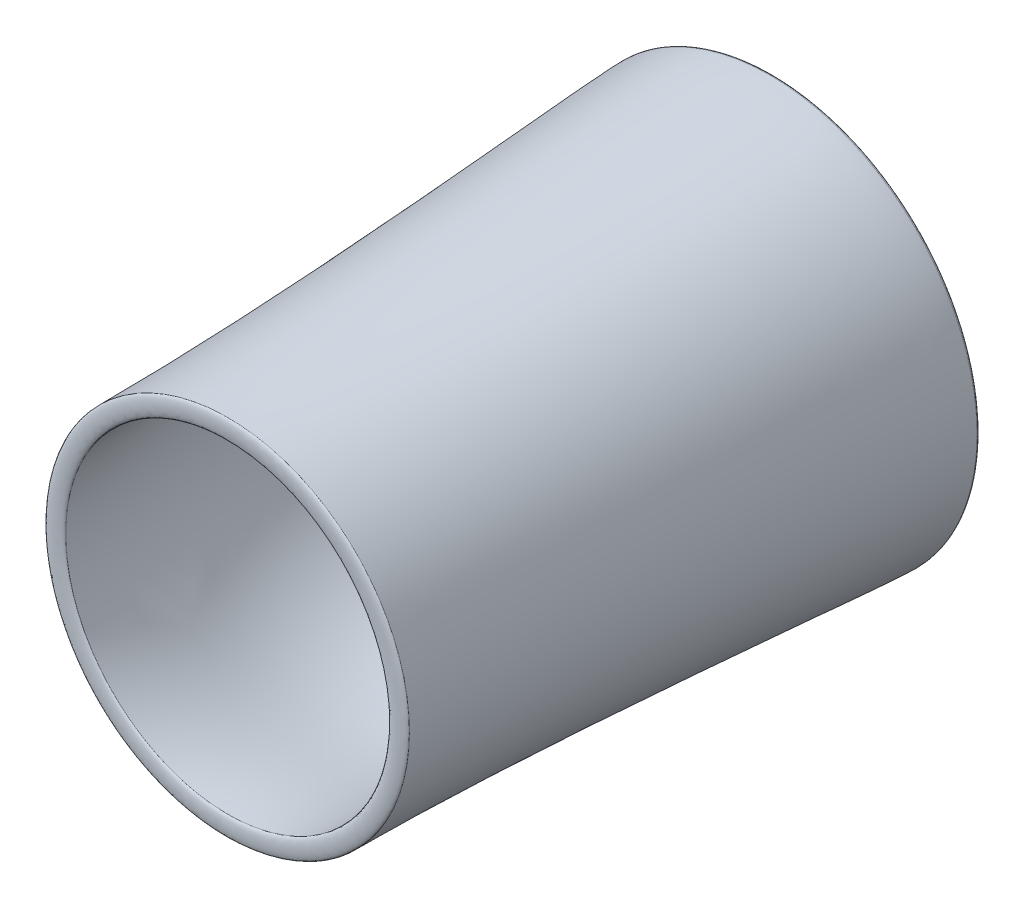
ISO-10303-21;
HEADER;
FILE_DESCRIPTION(('STEP AP214'),'2;1');
FILE_NAME('part.step','',(''),(''),'','','');
FILE_SCHEMA(('AUTOMOTIVE_DESIGN { 1 0 10303 214 1 1 1 1 }'));
ENDSEC;
DATA;
#1=APPLICATION_CONTEXT('core data for automotive mechanical design processes');
#2=APPLICATION_PROTOCOL_DEFINITION('international standard','automotive_design',2000,#1);
#3=PRODUCT_CONTEXT('',#1,'mechanical');
#4=PRODUCT('Part','Part','',(#3));
#5=PRODUCT_RELATED_PRODUCT_CATEGORY('part','',(#4));
#6=PRODUCT_DEFINITION_FORMATION('','',#4);
#7=PRODUCT_DEFINITION_CONTEXT('part definition',#1,'design');
#8=PRODUCT_DEFINITION('design','',#6,#7);
#9=PRODUCT_DEFINITION_SHAPE('','',#8);
#10=(LENGTH_UNIT() NAMED_UNIT(*) SI_UNIT(.MILLI.,.METRE.));
#11=(NAMED_UNIT(*) PLANE_ANGLE_UNIT() SI_UNIT($,.RADIAN.));
#12=(NAMED_UNIT(*) SI_UNIT($,.STERADIAN.) SOLID_ANGLE_UNIT());
#13=UNCERTAINTY_MEASURE_WITH_UNIT(LENGTH_MEASURE(1.E-05),#10,'distance_accuracy_value','');
#14=(GEOMETRIC_REPRESENTATION_CONTEXT(3) GLOBAL_UNCERTAINTY_ASSIGNED_CONTEXT((#13)) GLOBAL_UNIT_ASSIGNED_CONTEXT((#10,
#11,#12)) REPRESENTATION_CONTEXT('',''));
#15=CARTESIAN_POINT('',(0.,0.,0.));
#16=DIRECTION('',(0.,0.,1.));
#17=DIRECTION('',(1.,0.,0.));
#18=AXIS2_PLACEMENT_3D('',#15,#16,#17);
#19=CARTESIAN_POINT('',(-623.081922494606,0.,1297.82214060175));
#20=CARTESIAN_POINT('',(-623.081922494606,0.,1310.52214060175));
#21=CARTESIAN_POINT('',(-556.631697094474,0.,1310.52214060175));
#22=CARTESIAN_POINT('',(-556.631697094474,0.,1297.82214060175));
#23=B_SPLINE_CURVE_WITH_KNOTS('',3,(#19,#20,#21,#22),.UNSPECIFIED.,.F.,.F.,(4,4),(0.,1.),.UNSPECIFIED.);
#24=CARTESIAN_POINT('',(0.,0.,1104.75683012291));
#25=DIRECTION('',(0.,0.,1.));
#26=AXIS1_PLACEMENT('',#24,#25);
#27=SURFACE_OF_REVOLUTION('',#23,#26);
#28=CARTESIAN_POINT('',(0.,0.,1297.82214060175));
#29=DIRECTION('',(0.,0.,1.));
#30=DIRECTION('',(1.,0.,0.));
#31=AXIS2_PLACEMENT_3D('',#28,#29,#30);
#32=CIRCLE('',#31,556.631697094474);
#33=CARTESIAN_POINT('',(556.631697094474,0.,1297.82214060175));
#34=VERTEX_POINT('',#33);
#35=EDGE_CURVE('E47',#34,#34,#32,.T.);
#36=ORIENTED_EDGE('',*,*,#35,.F.);
#37=EDGE_LOOP('',(#36));
#38=FACE_BOUND('',#37,.T.);
#39=CARTESIAN_POINT('',(0.,0.,1297.82214060175));
#40=DIRECTION('',(0.,0.,1.));
#41=DIRECTION('',(1.,0.,0.));
#42=AXIS2_PLACEMENT_3D('',#39,#40,#41);
#43=CIRCLE('',#42,623.081922494606);
#44=CARTESIAN_POINT('',(623.081922494606,0.,1297.82214060175));
#45=VERTEX_POINT('',#44);
#46=EDGE_CURVE('E11',#45,#45,#43,.T.);
#47=ORIENTED_EDGE('',*,*,#46,.T.);
#48=EDGE_LOOP('',(#47));
#49=FACE_BOUND('',#48,.T.);
#50=ADVANCED_FACE('F40',(#38,#49),#27,.T.);
#51=CARTESIAN_POINT('',(-623.081922494606,0.,1297.82214060175));
#52=DIRECTION('',(0.,0.,1.));
#53=DIRECTION('',(1.,0.,0.));
#54=AXIS2_PLACEMENT_3D('',#51,#52,#53);
#55=PLANE('',#54);
#56=ORIENTED_EDGE('',*,*,#46,.F.);
#57=EDGE_LOOP('',(#56));
#58=FACE_BOUND('',#57,.T.);
#59=ORIENTED_EDGE('',*,*,#35,.T.);
#60=EDGE_LOOP('',(#59));
#61=FACE_BOUND('',#60,.T.);
#62=ADVANCED_FACE('F59',(#58,#61),#55,.F.);
#63=CLOSED_SHELL('',(#50,#62));
#64=MANIFOLD_SOLID_BREP('B2',#63);
#65=CARTESIAN_POINT('',(-663.06558111566,0.,-561.878149910584));
#66=CARTESIAN_POINT('',(-663.06558111566,0.,-578.811483243917));
#67=CARTESIAN_POINT('',(-711.609923736489,0.,-578.811483243917));
#68=CARTESIAN_POINT('',(-711.609923736489,0.,-561.878149910584));
#69=B_SPLINE_CURVE_WITH_KNOTS('',3,(#65,#66,#67,#68),.UNSPECIFIED.,.F.,.F.,(4,4),(0.,1.),.UNSPECIFIED.);
#70=CARTESIAN_POINT('',(0.,0.,99.6847843209707));
#71=DIRECTION('',(0.,0.,1.));
#72=AXIS1_PLACEMENT('',#70,#71);
#73=SURFACE_OF_REVOLUTION('',#69,#72);
#74=CARTESIAN_POINT('',(0.,0.,-561.878149910584));
#75=DIRECTION('',(0.,0.,1.));
#76=DIRECTION('',(1.,0.,0.));
#77=AXIS2_PLACEMENT_3D('',#74,#75,#76);
#78=CIRCLE('',#77,711.609923736489);
#79=CARTESIAN_POINT('',(711.609923736489,0.,-561.878149910584));
#80=VERTEX_POINT('',#79);
#81=EDGE_CURVE('E39',#80,#80,#78,.T.);
#82=ORIENTED_EDGE('',*,*,#81,.F.);
#83=EDGE_LOOP('',(#82));
#84=FACE_BOUND('',#83,.T.);
#85=CARTESIAN_POINT('',(0.,0.,-561.878149910584));
#86=DIRECTION('',(0.,0.,1.));
#87=DIRECTION('',(1.,0.,0.));
#88=AXIS2_PLACEMENT_3D('',#85,#86,#87);
#89=CIRCLE('',#88,663.06558111566);
#90=CARTESIAN_POINT('',(663.06558111566,0.,-561.878149910584));
#91=VERTEX_POINT('',#90);
#92=EDGE_CURVE('E93',#91,#91,#89,.T.);
#93=ORIENTED_EDGE('',*,*,#92,.T.);
#94=EDGE_LOOP('',(#93));
#95=FACE_BOUND('',#94,.T.);
#96=ADVANCED_FACE('F86',(#84,#95),#73,.T.);
#97=CARTESIAN_POINT('',(-711.609923736489,0.,-561.878149910584));
#98=DIRECTION('',(0.,0.,-1.));
#99=DIRECTION('',(-1.,0.,0.));
#100=AXIS2_PLACEMENT_3D('',#97,#98,#99);
#101=PLANE('',#100);
#102=ORIENTED_EDGE('',*,*,#92,.F.);
#103=EDGE_LOOP('',(#102));
#104=FACE_BOUND('',#103,.T.);
#105=ORIENTED_EDGE('',*,*,#81,.T.);
#106=EDGE_LOOP('',(#105));
#107=FACE_BOUND('',#106,.T.);
#108=ADVANCED_FACE('F106',(#104,#107),#101,.F.);
#109=CLOSED_SHELL('',(#96,#108));
#110=MANIFOLD_SOLID_BREP('B6',#109);
#111=CARTESIAN_POINT('',(-556.631697094474,0.,1297.82214060175));
#112=CARTESIAN_POINT('',(-556.631697094485,0.,1008.71351996186));
#113=CARTESIAN_POINT('',(-651.108600420085,0.,812.706109310214));
#114=CARTESIAN_POINT('',(-570.36020930639,0.,82.5553797782322));
#115=CARTESIAN_POINT('',(-605.315551478607,0.,-116.420781354776));
#116=CARTESIAN_POINT('',(-663.06558111566,0.,-509.24239738857));
#117=CARTESIAN_POINT('',(-663.06558111566,0.,-561.878149910584));
#118=B_SPLINE_CURVE_WITH_KNOTS('',3,(#111,#112,#113,#114,#115,#116,#117),.UNSPECIFIED.,.F.,.F.,
(4,1,1,1,4),(0.,0.515022649097204,0.793493092504956,0.841990827595236,1.),.UNSPECIFIED.);
#119=CARTESIAN_POINT('',(0.,0.,99.6847843209707));
#120=DIRECTION('',(0.,0.,1.));
#121=AXIS1_PLACEMENT('',#119,#120);
#122=SURFACE_OF_REVOLUTION('',#118,#121);
#123=CARTESIAN_POINT('',(0.,0.,-561.878149910584));
#124=DIRECTION('',(0.,0.,1.));
#125=DIRECTION('',(1.,0.,0.));
#126=AXIS2_PLACEMENT_3D('',#123,#124,#125);
#127=CIRCLE('',#126,663.06558111566);
#128=CARTESIAN_POINT('',(663.06558111566,0.,-561.878149910584));
#129=VERTEX_POINT('',#128);
#130=EDGE_CURVE('E140',#129,#129,#127,.T.);
#131=ORIENTED_EDGE('',*,*,#130,.F.);
#132=EDGE_LOOP('',(#131));
#133=FACE_BOUND('',#132,.T.);
#134=CARTESIAN_POINT('',(0.,0.,1297.82214060175));
#135=DIRECTION('',(0.,0.,1.));
#136=DIRECTION('',(1.,0.,0.));
#137=AXIS2_PLACEMENT_3D('',#134,#135,#136);
#138=CIRCLE('',#137,556.631697094474);
#139=CARTESIAN_POINT('',(556.631697094474,0.,1297.82214060175));
#140=VERTEX_POINT('',#139);
#141=EDGE_CURVE('E85',#140,#140,#138,.T.);
#142=ORIENTED_EDGE('',*,*,#141,.T.);
#143=EDGE_LOOP('',(#142));
#144=FACE_BOUND('',#143,.T.);
#145=ADVANCED_FACE('F125',(#133,#144),#122,.T.);
#146=CARTESIAN_POINT('',(-556.631697094474,0.,1297.82214060175));
#147=DIRECTION('',(0.,0.,-1.));
#148=DIRECTION('',(-1.,0.,0.));
#149=AXIS2_PLACEMENT_3D('',#146,#147,#148);
#150=PLANE('',#149);
#151=ORIENTED_EDGE('',*,*,#141,.F.);
#152=EDGE_LOOP('',(#151));
#153=FACE_BOUND('',#152,.T.);
#154=CARTESIAN_POINT('',(0.,0.,1297.82214060176));
#155=DIRECTION('',(0.,0.,1.));
#156=DIRECTION('',(1.,0.,0.));
#157=AXIS2_PLACEMENT_3D('',#154,#155,#156);
#158=CIRCLE('',#157,623.081922494606);
#159=CARTESIAN_POINT('',(623.081922494606,0.,1297.82214060176));
#160=VERTEX_POINT('',#159);
#161=EDGE_CURVE('E132',#160,#160,#158,.T.);
#162=ORIENTED_EDGE('',*,*,#161,.T.);
#163=EDGE_LOOP('',(#162));
#164=FACE_BOUND('',#163,.T.);
#165=ADVANCED_FACE('F159',(#153,#164),#150,.F.);
#166=CARTESIAN_POINT('',(-711.609923736489,0.,-561.878149910584));
#167=CARTESIAN_POINT('',(-711.609923736489,0.,-436.494197534291));
#168=CARTESIAN_POINT('',(-623.081922494606,0.,567.513020216516));
#169=CARTESIAN_POINT('',(-623.081922494606,0.,1297.82214060176));
#170=B_SPLINE_CURVE_WITH_KNOTS('',3,(#166,#167,#168,#169),.UNSPECIFIED.,.F.,.F.,(4,4),(0.,1.),.UNSPECIFIED.);
#171=CARTESIAN_POINT('',(0.,0.,99.6847843209707));
#172=DIRECTION('',(0.,0.,1.));
#173=AXIS1_PLACEMENT('',#171,#172);
#174=SURFACE_OF_REVOLUTION('',#170,#173);
#175=ORIENTED_EDGE('',*,*,#161,.F.);
#176=EDGE_LOOP('',(#175));
#177=FACE_BOUND('',#176,.T.);
#178=CARTESIAN_POINT('',(0.,0.,-561.878149910584));
#179=DIRECTION('',(0.,0.,1.));
#180=DIRECTION('',(1.,0.,0.));
#181=AXIS2_PLACEMENT_3D('',#178,#179,#180);
#182=CIRCLE('',#181,711.609923736489);
#183=CARTESIAN_POINT('',(711.609923736489,0.,-561.878149910584));
#184=VERTEX_POINT('',#183);
#185=EDGE_CURVE('E136',#184,#184,#182,.T.);
#186=ORIENTED_EDGE('',*,*,#185,.T.);
#187=EDGE_LOOP('',(#186));
#188=FACE_BOUND('',#187,.T.);
#189=ADVANCED_FACE('F155',(#177,#188),#174,.T.);
#190=CARTESIAN_POINT('',(-663.06558111566,0.,-561.878149910584));
#191=DIRECTION('',(0.,0.,1.));
#192=DIRECTION('',(1.,0.,0.));
#193=AXIS2_PLACEMENT_3D('',#190,#191,#192);
#194=PLANE('',#193);
#195=ORIENTED_EDGE('',*,*,#185,.F.);
#196=EDGE_LOOP('',(#195));
#197=FACE_BOUND('',#196,.T.);
#198=ORIENTED_EDGE('',*,*,#130,.T.);
#199=EDGE_LOOP('',(#198));
#200=FACE_BOUND('',#199,.T.);
#201=ADVANCED_FACE('F158',(#197,#200),#194,.F.);
#202=CLOSED_SHELL('',(#145,#165,#189,#201));
#203=MANIFOLD_SOLID_BREP('B34',#202);
#204=ADVANCED_BREP_SHAPE_REPRESENTATION('',(#18,#64,#110,#203),#14);
#205=SHAPE_DEFINITION_REPRESENTATION(#9,#204);
ENDSEC;
END-ISO-10303-21;
